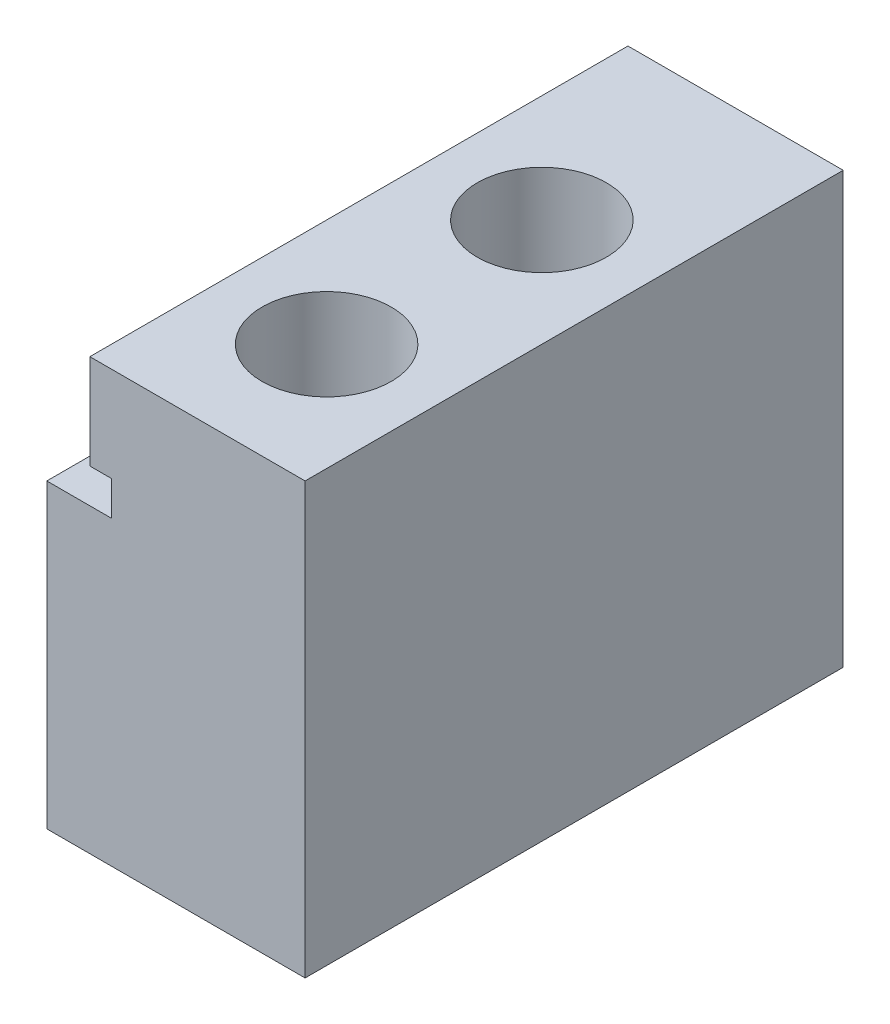
ISO-10303-21;
HEADER;
FILE_DESCRIPTION(('STEP AP214'),'2;1');
FILE_NAME('part.step','',(''),(''),'','','');
FILE_SCHEMA(('AUTOMOTIVE_DESIGN { 1 0 10303 214 1 1 1 1 }'));
ENDSEC;
DATA;
#1=APPLICATION_CONTEXT('core data for automotive mechanical design processes');
#2=APPLICATION_PROTOCOL_DEFINITION('international standard','automotive_design',2000,#1);
#3=PRODUCT_CONTEXT('',#1,'mechanical');
#4=PRODUCT('Part','Part','',(#3));
#5=PRODUCT_RELATED_PRODUCT_CATEGORY('part','',(#4));
#6=PRODUCT_DEFINITION_FORMATION('','',#4);
#7=PRODUCT_DEFINITION_CONTEXT('part definition',#1,'design');
#8=PRODUCT_DEFINITION('design','',#6,#7);
#9=PRODUCT_DEFINITION_SHAPE('','',#8);
#10=(LENGTH_UNIT() NAMED_UNIT(*) SI_UNIT(.MILLI.,.METRE.));
#11=(NAMED_UNIT(*) PLANE_ANGLE_UNIT() SI_UNIT($,.RADIAN.));
#12=(NAMED_UNIT(*) SI_UNIT($,.STERADIAN.) SOLID_ANGLE_UNIT());
#13=UNCERTAINTY_MEASURE_WITH_UNIT(LENGTH_MEASURE(1.E-05),#10,'distance_accuracy_value','');
#14=(GEOMETRIC_REPRESENTATION_CONTEXT(3) GLOBAL_UNCERTAINTY_ASSIGNED_CONTEXT((#13)) GLOBAL_UNIT_ASSIGNED_CONTEXT((#10,
#11,#12)) REPRESENTATION_CONTEXT('',''));
#15=CARTESIAN_POINT('',(0.,0.,0.));
#16=DIRECTION('',(0.,0.,1.));
#17=DIRECTION('',(1.,0.,0.));
#18=AXIS2_PLACEMENT_3D('',#15,#16,#17);
#19=CARTESIAN_POINT('',(7.,20.,-6.));
#20=DIRECTION('',(0.,-1.,0.));
#21=DIRECTION('',(0.,0.,-1.));
#22=AXIS2_PLACEMENT_3D('',#19,#20,#21);
#23=CYLINDRICAL_SURFACE('',#22,1.75);
#24=CARTESIAN_POINT('',(7.,10.,-6.));
#25=DIRECTION('',(0.,1.,0.));
#26=DIRECTION('',(0.,0.,1.));
#27=AXIS2_PLACEMENT_3D('',#24,#25,#26);
#28=CIRCLE('',#27,1.75);
#29=CARTESIAN_POINT('',(7.,10.,-4.25));
#30=VERTEX_POINT('',#29);
#31=EDGE_CURVE('E160',#30,#30,#28,.T.);
#32=ORIENTED_EDGE('',*,*,#31,.T.);
#33=EDGE_LOOP('',(#32));
#34=FACE_BOUND('',#33,.T.);
#35=CARTESIAN_POINT('',(7.,3.,-6.));
#36=DIRECTION('',(0.,-1.,0.));
#37=DIRECTION('',(0.,0.,-1.));
#38=AXIS2_PLACEMENT_3D('',#35,#36,#37);
#39=CIRCLE('',#38,1.75);
#40=CARTESIAN_POINT('',(7.,3.,-7.75));
#41=VERTEX_POINT('',#40);
#42=EDGE_CURVE('E35',#41,#41,#39,.T.);
#43=ORIENTED_EDGE('',*,*,#42,.T.);
#44=EDGE_LOOP('',(#43));
#45=FACE_BOUND('',#44,.T.);
#46=ADVANCED_FACE('F31',(#34,#45),#23,.F.);
#47=CARTESIAN_POINT('',(7.,20.,-16.));
#48=DIRECTION('',(0.,-1.,0.));
#49=DIRECTION('',(0.,0.,-1.));
#50=AXIS2_PLACEMENT_3D('',#47,#48,#49);
#51=CYLINDRICAL_SURFACE('',#50,1.75);
#52=CARTESIAN_POINT('',(7.,10.,-16.));
#53=DIRECTION('',(0.,1.,0.));
#54=DIRECTION('',(0.,0.,1.));
#55=AXIS2_PLACEMENT_3D('',#52,#53,#54);
#56=CIRCLE('',#55,1.75);
#57=CARTESIAN_POINT('',(7.,10.,-14.25));
#58=VERTEX_POINT('',#57);
#59=EDGE_CURVE('E118',#58,#58,#56,.T.);
#60=ORIENTED_EDGE('',*,*,#59,.T.);
#61=EDGE_LOOP('',(#60));
#62=FACE_BOUND('',#61,.T.);
#63=CARTESIAN_POINT('',(7.,3.,-16.));
#64=DIRECTION('',(0.,-1.,0.));
#65=DIRECTION('',(0.,0.,-1.));
#66=AXIS2_PLACEMENT_3D('',#63,#64,#65);
#67=CIRCLE('',#66,1.75);
#68=CARTESIAN_POINT('',(7.,3.,-17.75));
#69=VERTEX_POINT('',#68);
#70=EDGE_CURVE('E164',#69,#69,#67,.T.);
#71=ORIENTED_EDGE('',*,*,#70,.T.);
#72=EDGE_LOOP('',(#71));
#73=FACE_BOUND('',#72,.T.);
#74=ADVANCED_FACE('F216',(#62,#73),#51,.F.);
#75=CARTESIAN_POINT('',(0.,20.,-25.));
#76=DIRECTION('',(0.,-1.,0.));
#77=DIRECTION('',(0.,0.,-1.));
#78=AXIS2_PLACEMENT_3D('',#75,#76,#77);
#79=PLANE('',#78);
#80=CARTESIAN_POINT('',(7.,20.,-6.));
#81=DIRECTION('',(0.,1.,0.));
#82=DIRECTION('',(0.,0.,1.));
#83=AXIS2_PLACEMENT_3D('',#80,#81,#82);
#84=CIRCLE('',#83,3.);
#85=CARTESIAN_POINT('',(7.,20.,-3.));
#86=VERTEX_POINT('',#85);
#87=EDGE_CURVE('E166',#86,#86,#84,.T.);
#88=ORIENTED_EDGE('',*,*,#87,.F.);
#89=EDGE_LOOP('',(#88));
#90=FACE_BOUND('',#89,.T.);
#91=CARTESIAN_POINT('',(7.,20.,-16.));
#92=DIRECTION('',(0.,1.,0.));
#93=DIRECTION('',(0.,0.,1.));
#94=AXIS2_PLACEMENT_3D('',#91,#92,#93);
#95=CIRCLE('',#94,3.);
#96=CARTESIAN_POINT('',(7.,20.,-13.));
#97=VERTEX_POINT('',#96);
#98=EDGE_CURVE('E162',#97,#97,#95,.T.);
#99=ORIENTED_EDGE('',*,*,#98,.F.);
#100=EDGE_LOOP('',(#99));
#101=FACE_BOUND('',#100,.T.);
#102=DIRECTION('',(0.,0.,-1.));
#103=VECTOR('',#102,1.);
#104=CARTESIAN_POINT('',(2.,20.,0.));
#105=LINE('',#104,#103);
#106=CARTESIAN_POINT('',(2.,20.,0.));
#107=VERTEX_POINT('',#106);
#108=CARTESIAN_POINT('',(2.,20.,-25.));
#109=VERTEX_POINT('',#108);
#110=EDGE_CURVE('E113',#107,#109,#105,.T.);
#111=ORIENTED_EDGE('',*,*,#110,.F.);
#112=DIRECTION('',(1.,0.,0.));
#113=VECTOR('',#112,1.);
#114=CARTESIAN_POINT('',(0.,20.,0.));
#115=LINE('',#114,#113);
#116=CARTESIAN_POINT('',(12.,20.,0.));
#117=VERTEX_POINT('',#116);
#118=EDGE_CURVE('E134',#107,#117,#115,.T.);
#119=ORIENTED_EDGE('',*,*,#118,.T.);
#120=DIRECTION('',(0.,0.,-1.));
#121=VECTOR('',#120,1.);
#122=CARTESIAN_POINT('',(12.,20.,0.));
#123=LINE('',#122,#121);
#124=CARTESIAN_POINT('',(12.,20.,-25.));
#125=VERTEX_POINT('',#124);
#126=EDGE_CURVE('E136',#117,#125,#123,.T.);
#127=ORIENTED_EDGE('',*,*,#126,.T.);
#128=DIRECTION('',(-1.,0.,0.));
#129=VECTOR('',#128,1.);
#130=CARTESIAN_POINT('',(0.,20.,-25.));
#131=LINE('',#130,#129);
#132=EDGE_CURVE('E139',#125,#109,#131,.T.);
#133=ORIENTED_EDGE('',*,*,#132,.T.);
#134=EDGE_LOOP('',(#111,#119,#127,#133));
#135=FACE_BOUND('',#134,.T.);
#136=ADVANCED_FACE('F214',(#90,#101,#135),#79,.F.);
#137=CARTESIAN_POINT('',(0.,20.,0.));
#138=DIRECTION('',(1.,0.,0.));
#139=DIRECTION('',(0.,0.,-1.));
#140=AXIS2_PLACEMENT_3D('',#137,#138,#139);
#141=PLANE('',#140);
#142=DIRECTION('',(0.,0.,-1.));
#143=VECTOR('',#142,1.);
#144=CARTESIAN_POINT('',(0.,14.,0.));
#145=LINE('',#144,#143);
#146=CARTESIAN_POINT('',(0.,14.,0.));
#147=VERTEX_POINT('',#146);
#148=CARTESIAN_POINT('',(0.,14.,-25.));
#149=VERTEX_POINT('',#148);
#150=EDGE_CURVE('E131',#147,#149,#145,.T.);
#151=ORIENTED_EDGE('',*,*,#150,.T.);
#152=DIRECTION('',(0.,-1.,0.));
#153=VECTOR('',#152,1.);
#154=CARTESIAN_POINT('',(0.,20.,-25.));
#155=LINE('',#154,#153);
#156=CARTESIAN_POINT('',(0.,0.,-25.));
#157=VERTEX_POINT('',#156);
#158=EDGE_CURVE('E141',#149,#157,#155,.T.);
#159=ORIENTED_EDGE('',*,*,#158,.T.);
#160=DIRECTION('',(0.,0.,1.));
#161=VECTOR('',#160,1.);
#162=CARTESIAN_POINT('',(0.,0.,0.));
#163=LINE('',#162,#161);
#164=CARTESIAN_POINT('',(0.,0.,0.));
#165=VERTEX_POINT('',#164);
#166=EDGE_CURVE('E142',#157,#165,#163,.T.);
#167=ORIENTED_EDGE('',*,*,#166,.T.);
#168=DIRECTION('',(0.,-1.,0.));
#169=VECTOR('',#168,1.);
#170=CARTESIAN_POINT('',(0.,20.,0.));
#171=LINE('',#170,#169);
#172=EDGE_CURVE('E114',#147,#165,#171,.T.);
#173=ORIENTED_EDGE('',*,*,#172,.F.);
#174=EDGE_LOOP('',(#151,#159,#167,#173));
#175=FACE_BOUND('',#174,.T.);
#176=ADVANCED_FACE('F33',(#175),#141,.F.);
#177=CARTESIAN_POINT('',(0.,20.,0.));
#178=DIRECTION('',(0.,0.,-1.));
#179=DIRECTION('',(-1.,0.,0.));
#180=AXIS2_PLACEMENT_3D('',#177,#178,#179);
#181=PLANE('',#180);
#182=DIRECTION('',(1.,0.,0.));
#183=VECTOR('',#182,1.);
#184=CARTESIAN_POINT('',(0.,14.,0.));
#185=LINE('',#184,#183);
#186=CARTESIAN_POINT('',(3.,14.,0.));
#187=VERTEX_POINT('',#186);
#188=EDGE_CURVE('E133',#147,#187,#185,.T.);
#189=ORIENTED_EDGE('',*,*,#188,.F.);
#190=ORIENTED_EDGE('',*,*,#172,.T.);
#191=DIRECTION('',(1.,0.,0.));
#192=VECTOR('',#191,1.);
#193=CARTESIAN_POINT('',(0.,0.,0.));
#194=LINE('',#193,#192);
#195=CARTESIAN_POINT('',(12.,0.,0.));
#196=VERTEX_POINT('',#195);
#197=EDGE_CURVE('E145',#165,#196,#194,.T.);
#198=ORIENTED_EDGE('',*,*,#197,.T.);
#199=DIRECTION('',(0.,-1.,0.));
#200=VECTOR('',#199,1.);
#201=CARTESIAN_POINT('',(12.,20.,0.));
#202=LINE('',#201,#200);
#203=EDGE_CURVE('E155',#117,#196,#202,.T.);
#204=ORIENTED_EDGE('',*,*,#203,.F.);
#205=ORIENTED_EDGE('',*,*,#118,.F.);
#206=DIRECTION('',(0.,1.,0.));
#207=VECTOR('',#206,1.);
#208=CARTESIAN_POINT('',(2.,15.6,0.));
#209=LINE('',#208,#207);
#210=CARTESIAN_POINT('',(2.,15.6,0.));
#211=VERTEX_POINT('',#210);
#212=EDGE_CURVE('E117',#211,#107,#209,.T.);
#213=ORIENTED_EDGE('',*,*,#212,.F.);
#214=DIRECTION('',(-1.,0.,0.));
#215=VECTOR('',#214,1.);
#216=CARTESIAN_POINT('',(3.,15.6,0.));
#217=LINE('',#216,#215);
#218=CARTESIAN_POINT('',(3.,15.6,0.));
#219=VERTEX_POINT('',#218);
#220=EDGE_CURVE('E53',#219,#211,#217,.T.);
#221=ORIENTED_EDGE('',*,*,#220,.F.);
#222=DIRECTION('',(0.,1.,0.));
#223=VECTOR('',#222,1.);
#224=CARTESIAN_POINT('',(3.,14.,0.));
#225=LINE('',#224,#223);
#226=EDGE_CURVE('E48',#187,#219,#225,.T.);
#227=ORIENTED_EDGE('',*,*,#226,.F.);
#228=EDGE_LOOP('',(#189,#190,#198,#204,#205,#213,#221,#227));
#229=FACE_BOUND('',#228,.T.);
#230=ADVANCED_FACE('F198',(#229),#181,.F.);
#231=CARTESIAN_POINT('',(0.,20.,-25.));
#232=DIRECTION('',(0.,0.,1.));
#233=DIRECTION('',(1.,0.,0.));
#234=AXIS2_PLACEMENT_3D('',#231,#232,#233);
#235=PLANE('',#234);
#236=DIRECTION('',(-1.,0.,0.));
#237=VECTOR('',#236,1.);
#238=CARTESIAN_POINT('',(0.,14.,-25.));
#239=LINE('',#238,#237);
#240=CARTESIAN_POINT('',(3.,14.,-25.));
#241=VERTEX_POINT('',#240);
#242=EDGE_CURVE('E11',#241,#149,#239,.T.);
#243=ORIENTED_EDGE('',*,*,#242,.F.);
#244=DIRECTION('',(0.,-1.,0.));
#245=VECTOR('',#244,1.);
#246=CARTESIAN_POINT('',(3.,20.,-25.));
#247=LINE('',#246,#245);
#248=CARTESIAN_POINT('',(3.,15.6,-25.));
#249=VERTEX_POINT('',#248);
#250=EDGE_CURVE('E40',#249,#241,#247,.T.);
#251=ORIENTED_EDGE('',*,*,#250,.F.);
#252=DIRECTION('',(1.,0.,0.));
#253=VECTOR('',#252,1.);
#254=CARTESIAN_POINT('',(0.,15.6,-25.));
#255=LINE('',#254,#253);
#256=CARTESIAN_POINT('',(2.,15.6,-25.));
#257=VERTEX_POINT('',#256);
#258=EDGE_CURVE('E96',#257,#249,#255,.T.);
#259=ORIENTED_EDGE('',*,*,#258,.F.);
#260=DIRECTION('',(0.,-1.,0.));
#261=VECTOR('',#260,1.);
#262=CARTESIAN_POINT('',(2.,20.,-25.));
#263=LINE('',#262,#261);
#264=EDGE_CURVE('E100',#109,#257,#263,.T.);
#265=ORIENTED_EDGE('',*,*,#264,.F.);
#266=ORIENTED_EDGE('',*,*,#132,.F.);
#267=DIRECTION('',(0.,-1.,0.));
#268=VECTOR('',#267,1.);
#269=CARTESIAN_POINT('',(12.,20.,-25.));
#270=LINE('',#269,#268);
#271=CARTESIAN_POINT('',(12.,0.,-25.));
#272=VERTEX_POINT('',#271);
#273=EDGE_CURVE('E152',#125,#272,#270,.T.);
#274=ORIENTED_EDGE('',*,*,#273,.T.);
#275=DIRECTION('',(-1.,0.,0.));
#276=VECTOR('',#275,1.);
#277=CARTESIAN_POINT('',(0.,0.,-25.));
#278=LINE('',#277,#276);
#279=EDGE_CURVE('E137',#272,#157,#278,.T.);
#280=ORIENTED_EDGE('',*,*,#279,.T.);
#281=ORIENTED_EDGE('',*,*,#158,.F.);
#282=EDGE_LOOP('',(#243,#251,#259,#265,#266,#274,#280,#281));
#283=FACE_BOUND('',#282,.T.);
#284=ADVANCED_FACE('F98',(#283),#235,.F.);
#285=CARTESIAN_POINT('',(0.,0.,-25.));
#286=DIRECTION('',(0.,-1.,0.));
#287=DIRECTION('',(0.,0.,-1.));
#288=AXIS2_PLACEMENT_3D('',#285,#286,#287);
#289=PLANE('',#288);
#290=CARTESIAN_POINT('',(7.,0.,-6.));
#291=DIRECTION('',(0.,-1.,0.));
#292=DIRECTION('',(0.,0.,-1.));
#293=AXIS2_PLACEMENT_3D('',#290,#291,#292);
#294=CIRCLE('',#293,3.75);
#295=CARTESIAN_POINT('',(7.,0.,-9.75));
#296=VERTEX_POINT('',#295);
#297=EDGE_CURVE('E180',#296,#296,#294,.T.);
#298=ORIENTED_EDGE('',*,*,#297,.F.);
#299=EDGE_LOOP('',(#298));
#300=FACE_BOUND('',#299,.T.);
#301=CARTESIAN_POINT('',(7.,0.,-16.));
#302=DIRECTION('',(0.,-1.,0.));
#303=DIRECTION('',(0.,0.,-1.));
#304=AXIS2_PLACEMENT_3D('',#301,#302,#303);
#305=CIRCLE('',#304,3.75);
#306=CARTESIAN_POINT('',(7.,0.,-19.75));
#307=VERTEX_POINT('',#306);
#308=EDGE_CURVE('E173',#307,#307,#305,.T.);
#309=ORIENTED_EDGE('',*,*,#308,.F.);
#310=EDGE_LOOP('',(#309));
#311=FACE_BOUND('',#310,.T.);
#312=ORIENTED_EDGE('',*,*,#166,.F.);
#313=ORIENTED_EDGE('',*,*,#279,.F.);
#314=DIRECTION('',(0.,0.,-1.));
#315=VECTOR('',#314,1.);
#316=CARTESIAN_POINT('',(12.,0.,0.));
#317=LINE('',#316,#315);
#318=EDGE_CURVE('E147',#196,#272,#317,.T.);
#319=ORIENTED_EDGE('',*,*,#318,.F.);
#320=ORIENTED_EDGE('',*,*,#197,.F.);
#321=EDGE_LOOP('',(#312,#313,#319,#320));
#322=FACE_BOUND('',#321,.T.);
#323=ADVANCED_FACE('F205',(#300,#311,#322),#289,.T.);
#324=CARTESIAN_POINT('',(12.,20.,0.));
#325=DIRECTION('',(-1.,0.,0.));
#326=DIRECTION('',(0.,0.,1.));
#327=AXIS2_PLACEMENT_3D('',#324,#325,#326);
#328=PLANE('',#327);
#329=ORIENTED_EDGE('',*,*,#318,.T.);
#330=ORIENTED_EDGE('',*,*,#273,.F.);
#331=ORIENTED_EDGE('',*,*,#126,.F.);
#332=ORIENTED_EDGE('',*,*,#203,.T.);
#333=EDGE_LOOP('',(#329,#330,#331,#332));
#334=FACE_BOUND('',#333,.T.);
#335=ADVANCED_FACE('F211',(#334),#328,.F.);
#336=CARTESIAN_POINT('',(0.,14.,0.));
#337=DIRECTION('',(0.,1.,0.));
#338=DIRECTION('',(0.,0.,1.));
#339=AXIS2_PLACEMENT_3D('',#336,#337,#338);
#340=PLANE('',#339);
#341=DIRECTION('',(0.,0.,-1.));
#342=VECTOR('',#341,1.);
#343=CARTESIAN_POINT('',(3.,14.,0.));
#344=LINE('',#343,#342);
#345=EDGE_CURVE('E128',#187,#241,#344,.T.);
#346=ORIENTED_EDGE('',*,*,#345,.T.);
#347=ORIENTED_EDGE('',*,*,#242,.T.);
#348=ORIENTED_EDGE('',*,*,#150,.F.);
#349=ORIENTED_EDGE('',*,*,#188,.T.);
#350=EDGE_LOOP('',(#346,#347,#348,#349));
#351=FACE_BOUND('',#350,.T.);
#352=ADVANCED_FACE('F196',(#351),#340,.T.);
#353=CARTESIAN_POINT('',(3.,14.,0.));
#354=DIRECTION('',(-1.,0.,0.));
#355=DIRECTION('',(0.,0.,1.));
#356=AXIS2_PLACEMENT_3D('',#353,#354,#355);
#357=PLANE('',#356);
#358=DIRECTION('',(0.,0.,-1.));
#359=VECTOR('',#358,1.);
#360=CARTESIAN_POINT('',(3.,15.6,0.));
#361=LINE('',#360,#359);
#362=EDGE_CURVE('E126',#219,#249,#361,.T.);
#363=ORIENTED_EDGE('',*,*,#362,.T.);
#364=ORIENTED_EDGE('',*,*,#250,.T.);
#365=ORIENTED_EDGE('',*,*,#345,.F.);
#366=ORIENTED_EDGE('',*,*,#226,.T.);
#367=EDGE_LOOP('',(#363,#364,#365,#366));
#368=FACE_BOUND('',#367,.T.);
#369=ADVANCED_FACE('F193',(#368),#357,.T.);
#370=CARTESIAN_POINT('',(3.,15.6,0.));
#371=DIRECTION('',(0.,-1.,0.));
#372=DIRECTION('',(0.,0.,-1.));
#373=AXIS2_PLACEMENT_3D('',#370,#371,#372);
#374=PLANE('',#373);
#375=DIRECTION('',(0.,0.,-1.));
#376=VECTOR('',#375,1.);
#377=CARTESIAN_POINT('',(2.,15.6,0.));
#378=LINE('',#377,#376);
#379=EDGE_CURVE('E112',#211,#257,#378,.T.);
#380=ORIENTED_EDGE('',*,*,#379,.T.);
#381=ORIENTED_EDGE('',*,*,#258,.T.);
#382=ORIENTED_EDGE('',*,*,#362,.F.);
#383=ORIENTED_EDGE('',*,*,#220,.T.);
#384=EDGE_LOOP('',(#380,#381,#382,#383));
#385=FACE_BOUND('',#384,.T.);
#386=ADVANCED_FACE('F116',(#385),#374,.T.);
#387=CARTESIAN_POINT('',(2.,15.6,0.));
#388=DIRECTION('',(-1.,0.,0.));
#389=DIRECTION('',(0.,0.,1.));
#390=AXIS2_PLACEMENT_3D('',#387,#388,#389);
#391=PLANE('',#390);
#392=ORIENTED_EDGE('',*,*,#110,.T.);
#393=ORIENTED_EDGE('',*,*,#264,.T.);
#394=ORIENTED_EDGE('',*,*,#379,.F.);
#395=ORIENTED_EDGE('',*,*,#212,.T.);
#396=EDGE_LOOP('',(#392,#393,#394,#395));
#397=FACE_BOUND('',#396,.T.);
#398=ADVANCED_FACE('F110',(#397),#391,.T.);
#399=CARTESIAN_POINT('',(7.,10.,-16.));
#400=DIRECTION('',(0.,1.,0.));
#401=DIRECTION('',(0.,0.,1.));
#402=AXIS2_PLACEMENT_3D('',#399,#400,#401);
#403=CYLINDRICAL_SURFACE('',#402,3.);
#404=CARTESIAN_POINT('',(7.,10.,-16.));
#405=DIRECTION('',(0.,1.,0.));
#406=DIRECTION('',(0.,0.,1.));
#407=AXIS2_PLACEMENT_3D('',#404,#405,#406);
#408=CIRCLE('',#407,3.);
#409=CARTESIAN_POINT('',(7.,10.,-13.));
#410=VERTEX_POINT('',#409);
#411=EDGE_CURVE('E122',#410,#410,#408,.T.);
#412=ORIENTED_EDGE('',*,*,#411,.F.);
#413=EDGE_LOOP('',(#412));
#414=FACE_BOUND('',#413,.T.);
#415=ORIENTED_EDGE('',*,*,#98,.T.);
#416=EDGE_LOOP('',(#415));
#417=FACE_BOUND('',#416,.T.);
#418=ADVANCED_FACE('F243',(#414,#417),#403,.F.);
#419=CARTESIAN_POINT('',(7.,10.,-16.));
#420=DIRECTION('',(0.,1.,0.));
#421=DIRECTION('',(0.,0.,1.));
#422=AXIS2_PLACEMENT_3D('',#419,#420,#421);
#423=PLANE('',#422);
#424=ORIENTED_EDGE('',*,*,#59,.F.);
#425=EDGE_LOOP('',(#424));
#426=FACE_BOUND('',#425,.T.);
#427=ORIENTED_EDGE('',*,*,#411,.T.);
#428=EDGE_LOOP('',(#427));
#429=FACE_BOUND('',#428,.T.);
#430=ADVANCED_FACE('F246',(#426,#429),#423,.T.);
#431=CARTESIAN_POINT('',(7.,10.,-6.));
#432=DIRECTION('',(0.,1.,0.));
#433=DIRECTION('',(0.,0.,1.));
#434=AXIS2_PLACEMENT_3D('',#431,#432,#433);
#435=CYLINDRICAL_SURFACE('',#434,3.);
#436=CARTESIAN_POINT('',(7.,10.,-6.));
#437=DIRECTION('',(0.,1.,0.));
#438=DIRECTION('',(0.,0.,1.));
#439=AXIS2_PLACEMENT_3D('',#436,#437,#438);
#440=CIRCLE('',#439,3.);
#441=CARTESIAN_POINT('',(7.,10.,-3.));
#442=VERTEX_POINT('',#441);
#443=EDGE_CURVE('E163',#442,#442,#440,.T.);
#444=ORIENTED_EDGE('',*,*,#443,.F.);
#445=EDGE_LOOP('',(#444));
#446=FACE_BOUND('',#445,.T.);
#447=ORIENTED_EDGE('',*,*,#87,.T.);
#448=EDGE_LOOP('',(#447));
#449=FACE_BOUND('',#448,.T.);
#450=ADVANCED_FACE('F250',(#446,#449),#435,.F.);
#451=CARTESIAN_POINT('',(7.,10.,-6.));
#452=DIRECTION('',(0.,1.,0.));
#453=DIRECTION('',(0.,0.,1.));
#454=AXIS2_PLACEMENT_3D('',#451,#452,#453);
#455=PLANE('',#454);
#456=ORIENTED_EDGE('',*,*,#31,.F.);
#457=EDGE_LOOP('',(#456));
#458=FACE_BOUND('',#457,.T.);
#459=ORIENTED_EDGE('',*,*,#443,.T.);
#460=EDGE_LOOP('',(#459));
#461=FACE_BOUND('',#460,.T.);
#462=ADVANCED_FACE('F254',(#458,#461),#455,.T.);
#463=CARTESIAN_POINT('',(7.,3.,-16.));
#464=DIRECTION('',(0.,-1.,0.));
#465=DIRECTION('',(0.,0.,-1.));
#466=AXIS2_PLACEMENT_3D('',#463,#464,#465);
#467=CYLINDRICAL_SURFACE('',#466,3.75);
#468=CARTESIAN_POINT('',(7.,3.,-16.));
#469=DIRECTION('',(0.,-1.,0.));
#470=DIRECTION('',(0.,0.,-1.));
#471=AXIS2_PLACEMENT_3D('',#468,#469,#470);
#472=CIRCLE('',#471,3.75);
#473=CARTESIAN_POINT('',(7.,3.,-19.75));
#474=VERTEX_POINT('',#473);
#475=EDGE_CURVE('E167',#474,#474,#472,.T.);
#476=ORIENTED_EDGE('',*,*,#475,.F.);
#477=EDGE_LOOP('',(#476));
#478=FACE_BOUND('',#477,.T.);
#479=ORIENTED_EDGE('',*,*,#308,.T.);
#480=EDGE_LOOP('',(#479));
#481=FACE_BOUND('',#480,.T.);
#482=ADVANCED_FACE('F258',(#478,#481),#467,.F.);
#483=CARTESIAN_POINT('',(7.,3.,-16.));
#484=DIRECTION('',(0.,-1.,0.));
#485=DIRECTION('',(0.,0.,-1.));
#486=AXIS2_PLACEMENT_3D('',#483,#484,#485);
#487=PLANE('',#486);
#488=ORIENTED_EDGE('',*,*,#70,.F.);
#489=EDGE_LOOP('',(#488));
#490=FACE_BOUND('',#489,.T.);
#491=ORIENTED_EDGE('',*,*,#475,.T.);
#492=EDGE_LOOP('',(#491));
#493=FACE_BOUND('',#492,.T.);
#494=ADVANCED_FACE('F262',(#490,#493),#487,.T.);
#495=CARTESIAN_POINT('',(7.,3.,-6.));
#496=DIRECTION('',(0.,-1.,0.));
#497=DIRECTION('',(0.,0.,-1.));
#498=AXIS2_PLACEMENT_3D('',#495,#496,#497);
#499=CYLINDRICAL_SURFACE('',#498,3.75);
#500=CARTESIAN_POINT('',(7.,3.,-6.));
#501=DIRECTION('',(0.,-1.,0.));
#502=DIRECTION('',(0.,0.,-1.));
#503=AXIS2_PLACEMENT_3D('',#500,#501,#502);
#504=CIRCLE('',#503,3.75);
#505=CARTESIAN_POINT('',(7.,3.,-9.75));
#506=VERTEX_POINT('',#505);
#507=EDGE_CURVE('E281',#506,#506,#504,.T.);
#508=ORIENTED_EDGE('',*,*,#507,.F.);
#509=EDGE_LOOP('',(#508));
#510=FACE_BOUND('',#509,.T.);
#511=ORIENTED_EDGE('',*,*,#297,.T.);
#512=EDGE_LOOP('',(#511));
#513=FACE_BOUND('',#512,.T.);
#514=ADVANCED_FACE('F266',(#510,#513),#499,.F.);
#515=CARTESIAN_POINT('',(7.,3.,-6.));
#516=DIRECTION('',(0.,-1.,0.));
#517=DIRECTION('',(0.,0.,-1.));
#518=AXIS2_PLACEMENT_3D('',#515,#516,#517);
#519=PLANE('',#518);
#520=ORIENTED_EDGE('',*,*,#42,.F.);
#521=EDGE_LOOP('',(#520));
#522=FACE_BOUND('',#521,.T.);
#523=ORIENTED_EDGE('',*,*,#507,.T.);
#524=EDGE_LOOP('',(#523));
#525=FACE_BOUND('',#524,.T.);
#526=ADVANCED_FACE('F270',(#522,#525),#519,.T.);
#527=CLOSED_SHELL('',(#46,#74,#136,#176,#230,#284,#323,#335,#352,#369,#386,#398,#418,#430,#450,
#462,#482,#494,#514,#526));
#528=MANIFOLD_SOLID_BREP('B2',#527);
#529=ADVANCED_BREP_SHAPE_REPRESENTATION('',(#18,#528),#14);
#530=SHAPE_DEFINITION_REPRESENTATION(#9,#529);
ENDSEC;
END-ISO-10303-21;
